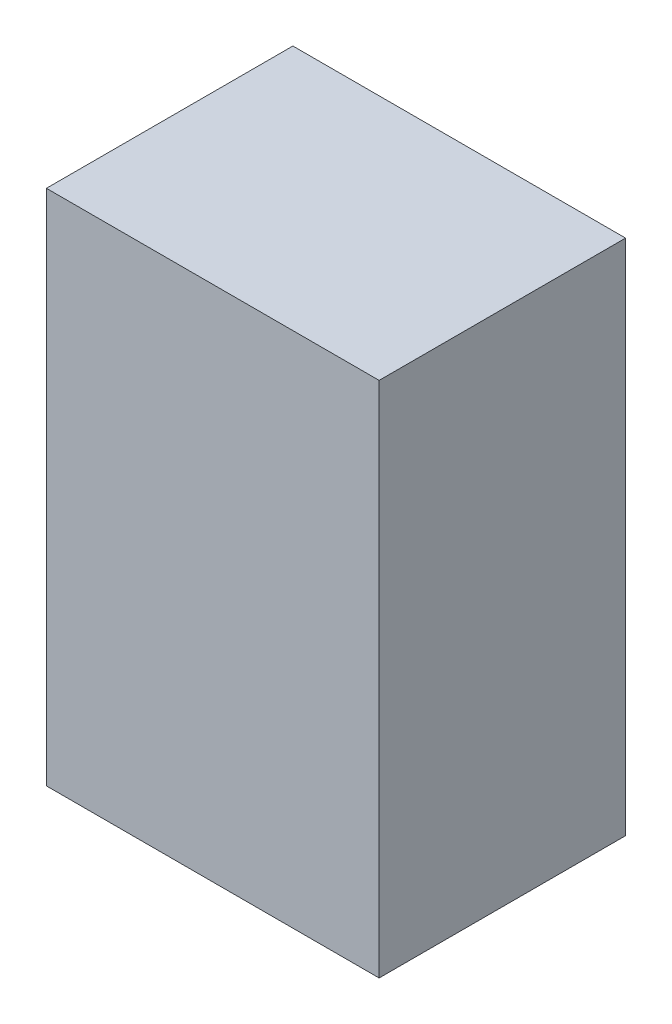
ISO-10303-21;
HEADER;
FILE_DESCRIPTION(('STEP AP214'),'2;1');
FILE_NAME('part.step','',(''),(''),'','','');
FILE_SCHEMA(('AUTOMOTIVE_DESIGN { 1 0 10303 214 1 1 1 1 }'));
ENDSEC;
DATA;
#1=APPLICATION_CONTEXT('core data for automotive mechanical design processes');
#2=APPLICATION_PROTOCOL_DEFINITION('international standard','automotive_design',2000,#1);
#3=PRODUCT_CONTEXT('',#1,'mechanical');
#4=PRODUCT('Part','Part','',(#3));
#5=PRODUCT_RELATED_PRODUCT_CATEGORY('part','',(#4));
#6=PRODUCT_DEFINITION_FORMATION('','',#4);
#7=PRODUCT_DEFINITION_CONTEXT('part definition',#1,'design');
#8=PRODUCT_DEFINITION('design','',#6,#7);
#9=PRODUCT_DEFINITION_SHAPE('','',#8);
#10=(LENGTH_UNIT() NAMED_UNIT(*) SI_UNIT(.MILLI.,.METRE.));
#11=(NAMED_UNIT(*) PLANE_ANGLE_UNIT() SI_UNIT($,.RADIAN.));
#12=(NAMED_UNIT(*) SI_UNIT($,.STERADIAN.) SOLID_ANGLE_UNIT());
#13=UNCERTAINTY_MEASURE_WITH_UNIT(LENGTH_MEASURE(1.E-05),#10,'distance_accuracy_value','');
#14=(GEOMETRIC_REPRESENTATION_CONTEXT(3) GLOBAL_UNCERTAINTY_ASSIGNED_CONTEXT((#13)) GLOBAL_UNIT_ASSIGNED_CONTEXT((#10,
#11,#12)) REPRESENTATION_CONTEXT('',''));
#15=CARTESIAN_POINT('',(0.,0.,0.));
#16=DIRECTION('',(0.,0.,1.));
#17=DIRECTION('',(1.,0.,0.));
#18=AXIS2_PLACEMENT_3D('',#15,#16,#17);
#19=CARTESIAN_POINT('',(0.67499992,-1.05000044,1.00000054));
#20=DIRECTION('',(0.,0.,-1.));
#21=DIRECTION('',(-1.,0.,0.));
#22=AXIS2_PLACEMENT_3D('',#19,#20,#21);
#23=PLANE('',#22);
#24=DIRECTION('',(1.,0.,0.));
#25=VECTOR('',#24,1.);
#26=CARTESIAN_POINT('',(0.67499992,1.05000044,1.00000054));
#27=LINE('',#26,#25);
#28=CARTESIAN_POINT('',(0.67499992,1.05000044,1.00000054));
#29=VERTEX_POINT('',#28);
#30=CARTESIAN_POINT('',(-0.67499992,1.05000044,1.00000054));
#31=VERTEX_POINT('',#30);
#32=EDGE_CURVE('E55',#29,#31,#27,.F.);
#33=ORIENTED_EDGE('',*,*,#32,.T.);
#34=DIRECTION('',(0.,1.,0.));
#35=VECTOR('',#34,1.);
#36=CARTESIAN_POINT('',(-0.67499992,1.05000044,1.00000054));
#37=LINE('',#36,#35);
#38=CARTESIAN_POINT('',(-0.67499992,-1.05000044,1.00000054));
#39=VERTEX_POINT('',#38);
#40=EDGE_CURVE('E57',#31,#39,#37,.F.);
#41=ORIENTED_EDGE('',*,*,#40,.T.);
#42=DIRECTION('',(1.,0.,0.));
#43=VECTOR('',#42,1.);
#44=CARTESIAN_POINT('',(-0.67499992,-1.05000044,1.00000054));
#45=LINE('',#44,#43);
#46=CARTESIAN_POINT('',(0.67499992,-1.05000044,1.00000054));
#47=VERTEX_POINT('',#46);
#48=EDGE_CURVE('E20',#39,#47,#45,.T.);
#49=ORIENTED_EDGE('',*,*,#48,.T.);
#50=DIRECTION('',(0.,1.,0.));
#51=VECTOR('',#50,1.);
#52=CARTESIAN_POINT('',(0.67499992,-1.05000044,1.00000054));
#53=LINE('',#52,#51);
#54=EDGE_CURVE('E80',#47,#29,#53,.T.);
#55=ORIENTED_EDGE('',*,*,#54,.T.);
#56=EDGE_LOOP('',(#33,#41,#49,#55));
#57=FACE_BOUND('',#56,.T.);
#58=ADVANCED_FACE('F17',(#57),#23,.F.);
#59=CARTESIAN_POINT('',(-0.67499992,-1.05000044,0.));
#60=DIRECTION('',(0.,1.,0.));
#61=DIRECTION('',(0.,0.,1.));
#62=AXIS2_PLACEMENT_3D('',#59,#60,#61);
#63=PLANE('',#62);
#64=DIRECTION('',(0.,0.,1.));
#65=VECTOR('',#64,1.);
#66=CARTESIAN_POINT('',(0.67499992,-1.05000044,0.));
#67=LINE('',#66,#65);
#68=CARTESIAN_POINT('',(0.67499992,-1.05000044,0.));
#69=VERTEX_POINT('',#68);
#70=EDGE_CURVE('E68',#69,#47,#67,.T.);
#71=ORIENTED_EDGE('',*,*,#70,.T.);
#72=ORIENTED_EDGE('',*,*,#48,.F.);
#73=DIRECTION('',(0.,0.,-1.));
#74=VECTOR('',#73,1.);
#75=CARTESIAN_POINT('',(-0.67499992,-1.05000044,0.));
#76=LINE('',#75,#74);
#77=CARTESIAN_POINT('',(-0.67499992,-1.05000044,0.));
#78=VERTEX_POINT('',#77);
#79=EDGE_CURVE('E63',#39,#78,#76,.T.);
#80=ORIENTED_EDGE('',*,*,#79,.T.);
#81=DIRECTION('',(-1.,0.,0.));
#82=VECTOR('',#81,1.);
#83=CARTESIAN_POINT('',(0.67499992,-1.05000044,0.));
#84=LINE('',#83,#82);
#85=EDGE_CURVE('E83',#69,#78,#84,.T.);
#86=ORIENTED_EDGE('',*,*,#85,.F.);
#87=EDGE_LOOP('',(#71,#72,#80,#86));
#88=FACE_BOUND('',#87,.T.);
#89=ADVANCED_FACE('F65',(#88),#63,.F.);
#90=CARTESIAN_POINT('',(-0.67499992,1.05000044,0.));
#91=DIRECTION('',(1.,0.,0.));
#92=DIRECTION('',(0.,0.,-1.));
#93=AXIS2_PLACEMENT_3D('',#90,#91,#92);
#94=PLANE('',#93);
#95=ORIENTED_EDGE('',*,*,#79,.F.);
#96=ORIENTED_EDGE('',*,*,#40,.F.);
#97=DIRECTION('',(0.,0.,-1.));
#98=VECTOR('',#97,1.);
#99=CARTESIAN_POINT('',(-0.67499992,1.05000044,0.));
#100=LINE('',#99,#98);
#101=CARTESIAN_POINT('',(-0.67499992,1.05000044,0.));
#102=VERTEX_POINT('',#101);
#103=EDGE_CURVE('E75',#31,#102,#100,.T.);
#104=ORIENTED_EDGE('',*,*,#103,.T.);
#105=DIRECTION('',(0.,1.,0.));
#106=VECTOR('',#105,1.);
#107=CARTESIAN_POINT('',(-0.67499992,-1.05000044,0.));
#108=LINE('',#107,#106);
#109=EDGE_CURVE('E72',#78,#102,#108,.T.);
#110=ORIENTED_EDGE('',*,*,#109,.F.);
#111=EDGE_LOOP('',(#95,#96,#104,#110));
#112=FACE_BOUND('',#111,.T.);
#113=ADVANCED_FACE('F70',(#112),#94,.F.);
#114=CARTESIAN_POINT('',(0.67499992,1.05000044,0.));
#115=DIRECTION('',(0.,-1.,0.));
#116=DIRECTION('',(0.,0.,-1.));
#117=AXIS2_PLACEMENT_3D('',#114,#115,#116);
#118=PLANE('',#117);
#119=ORIENTED_EDGE('',*,*,#103,.F.);
#120=ORIENTED_EDGE('',*,*,#32,.F.);
#121=DIRECTION('',(0.,0.,1.));
#122=VECTOR('',#121,1.);
#123=CARTESIAN_POINT('',(0.67499992,1.05000044,0.));
#124=LINE('',#123,#122);
#125=CARTESIAN_POINT('',(0.67499992,1.05000044,0.));
#126=VERTEX_POINT('',#125);
#127=EDGE_CURVE('E35',#29,#126,#124,.F.);
#128=ORIENTED_EDGE('',*,*,#127,.T.);
#129=DIRECTION('',(-1.,0.,0.));
#130=VECTOR('',#129,1.);
#131=CARTESIAN_POINT('',(0.67499992,1.05000044,0.));
#132=LINE('',#131,#130);
#133=EDGE_CURVE('E26',#102,#126,#132,.F.);
#134=ORIENTED_EDGE('',*,*,#133,.F.);
#135=EDGE_LOOP('',(#119,#120,#128,#134));
#136=FACE_BOUND('',#135,.T.);
#137=ADVANCED_FACE('F89',(#136),#118,.F.);
#138=CARTESIAN_POINT('',(0.67499992,-1.05000044,0.));
#139=DIRECTION('',(-1.,0.,0.));
#140=DIRECTION('',(0.,0.,1.));
#141=AXIS2_PLACEMENT_3D('',#138,#139,#140);
#142=PLANE('',#141);
#143=ORIENTED_EDGE('',*,*,#127,.F.);
#144=ORIENTED_EDGE('',*,*,#54,.F.);
#145=ORIENTED_EDGE('',*,*,#70,.F.);
#146=DIRECTION('',(0.,1.,0.));
#147=VECTOR('',#146,1.);
#148=CARTESIAN_POINT('',(0.67499992,-1.05000044,0.));
#149=LINE('',#148,#147);
#150=EDGE_CURVE('E11',#126,#69,#149,.F.);
#151=ORIENTED_EDGE('',*,*,#150,.F.);
#152=EDGE_LOOP('',(#143,#144,#145,#151));
#153=FACE_BOUND('',#152,.T.);
#154=ADVANCED_FACE('F91',(#153),#142,.F.);
#155=CARTESIAN_POINT('',(0.67499992,-1.05000044,0.));
#156=DIRECTION('',(0.,0.,-1.));
#157=DIRECTION('',(-1.,0.,0.));
#158=AXIS2_PLACEMENT_3D('',#155,#156,#157);
#159=PLANE('',#158);
#160=ORIENTED_EDGE('',*,*,#133,.T.);
#161=ORIENTED_EDGE('',*,*,#150,.T.);
#162=ORIENTED_EDGE('',*,*,#85,.T.);
#163=ORIENTED_EDGE('',*,*,#109,.T.);
#164=EDGE_LOOP('',(#160,#161,#162,#163));
#165=FACE_BOUND('',#164,.T.);
#166=ADVANCED_FACE('F88',(#165),#159,.T.);
#167=CLOSED_SHELL('',(#58,#89,#113,#137,#154,#166));
#168=MANIFOLD_SOLID_BREP('B1',#167);
#169=ADVANCED_BREP_SHAPE_REPRESENTATION('',(#18,#168),#14);
#170=SHAPE_DEFINITION_REPRESENTATION(#9,#169);
ENDSEC;
END-ISO-10303-21;
